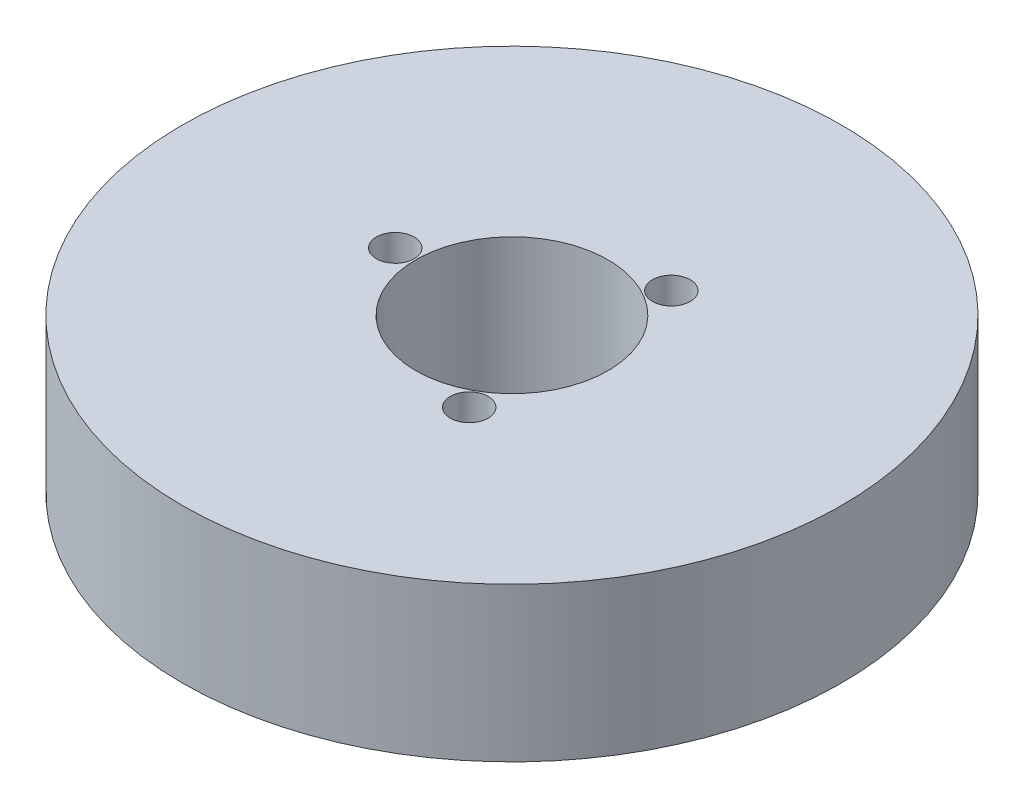
ISO-10303-21;
HEADER;
FILE_DESCRIPTION(('STEP AP214'),'2;1');
FILE_NAME('part.step','',(''),(''),'','','');
FILE_SCHEMA(('AUTOMOTIVE_DESIGN { 1 0 10303 214 1 1 1 1 }'));
ENDSEC;
DATA;
#1=APPLICATION_CONTEXT('core data for automotive mechanical design processes');
#2=APPLICATION_PROTOCOL_DEFINITION('international standard','automotive_design',2000,#1);
#3=PRODUCT_CONTEXT('',#1,'mechanical');
#4=PRODUCT('Part','Part','',(#3));
#5=PRODUCT_RELATED_PRODUCT_CATEGORY('part','',(#4));
#6=PRODUCT_DEFINITION_FORMATION('','',#4);
#7=PRODUCT_DEFINITION_CONTEXT('part definition',#1,'design');
#8=PRODUCT_DEFINITION('design','',#6,#7);
#9=PRODUCT_DEFINITION_SHAPE('','',#8);
#10=(LENGTH_UNIT() NAMED_UNIT(*) SI_UNIT(.MILLI.,.METRE.));
#11=(NAMED_UNIT(*) PLANE_ANGLE_UNIT() SI_UNIT($,.RADIAN.));
#12=(NAMED_UNIT(*) SI_UNIT($,.STERADIAN.) SOLID_ANGLE_UNIT());
#13=UNCERTAINTY_MEASURE_WITH_UNIT(LENGTH_MEASURE(1.E-05),#10,'distance_accuracy_value','');
#14=(GEOMETRIC_REPRESENTATION_CONTEXT(3) GLOBAL_UNCERTAINTY_ASSIGNED_CONTEXT((#13)) GLOBAL_UNIT_ASSIGNED_CONTEXT((#10,
#11,#12)) REPRESENTATION_CONTEXT('',''));
#15=CARTESIAN_POINT('',(0.,0.,0.));
#16=DIRECTION('',(0.,0.,1.));
#17=DIRECTION('',(1.,0.,0.));
#18=AXIS2_PLACEMENT_3D('',#15,#16,#17);
#19=CARTESIAN_POINT('',(0.,28.,0.));
#20=DIRECTION('',(0.,-1.,0.));
#21=DIRECTION('',(0.,0.,-1.));
#22=AXIS2_PLACEMENT_3D('',#19,#20,#21);
#23=CYLINDRICAL_SURFACE('',#22,60.);
#24=CARTESIAN_POINT('',(0.,28.,0.));
#25=DIRECTION('',(0.,1.,0.));
#26=DIRECTION('',(0.,0.,1.));
#27=AXIS2_PLACEMENT_3D('',#24,#25,#26);
#28=CIRCLE('',#27,60.);
#29=CARTESIAN_POINT('',(0.,28.,60.));
#30=VERTEX_POINT('',#29);
#31=EDGE_CURVE('E10',#30,#30,#28,.T.);
#32=ORIENTED_EDGE('',*,*,#31,.F.);
#33=EDGE_LOOP('',(#32));
#34=FACE_BOUND('',#33,.T.);
#35=CARTESIAN_POINT('',(0.,0.,0.));
#36=DIRECTION('',(0.,1.,0.));
#37=DIRECTION('',(0.,0.,1.));
#38=AXIS2_PLACEMENT_3D('',#35,#36,#37);
#39=CIRCLE('',#38,60.);
#40=CARTESIAN_POINT('',(0.,0.,60.));
#41=VERTEX_POINT('',#40);
#42=EDGE_CURVE('E37',#41,#41,#39,.T.);
#43=ORIENTED_EDGE('',*,*,#42,.T.);
#44=EDGE_LOOP('',(#43));
#45=FACE_BOUND('',#44,.T.);
#46=ADVANCED_FACE('F40',(#34,#45),#23,.T.);
#47=CARTESIAN_POINT('',(0.,28.,0.));
#48=DIRECTION('',(0.,1.,0.));
#49=DIRECTION('',(0.,0.,1.));
#50=AXIS2_PLACEMENT_3D('',#47,#48,#49);
#51=PLANE('',#50);
#52=CARTESIAN_POINT('',(10.6222236300377,28.,18.3982310165838));
#53=DIRECTION('',(0.,1.,0.));
#54=DIRECTION('',(0.866025403784436,0.,-0.500000000000004));
#55=AXIS2_PLACEMENT_3D('',#52,#53,#54);
#56=CIRCLE('',#55,3.44067264914023);
#57=CARTESIAN_POINT('',(13.6019335502994,28.,16.6778946920136));
#58=VERTEX_POINT('',#57);
#59=EDGE_CURVE('E70',#58,#58,#56,.T.);
#60=ORIENTED_EDGE('',*,*,#59,.F.);
#61=EDGE_LOOP('',(#60));
#62=FACE_BOUND('',#61,.T.);
#63=CARTESIAN_POINT('',(10.6222236300374,28.,-18.3982310165839));
#64=DIRECTION('',(0.,1.,0.));
#65=DIRECTION('',(-0.866025403784443,0.,-0.499999999999992));
#66=AXIS2_PLACEMENT_3D('',#63,#64,#65);
#67=CIRCLE('',#66,3.44067264914023);
#68=CARTESIAN_POINT('',(7.64251370977566,28.,-20.118567341154));
#69=VERTEX_POINT('',#68);
#70=EDGE_CURVE('E61',#69,#69,#67,.T.);
#71=ORIENTED_EDGE('',*,*,#70,.F.);
#72=EDGE_LOOP('',(#71));
#73=FACE_BOUND('',#72,.T.);
#74=CARTESIAN_POINT('',(-21.2444472600752,28.,0.));
#75=DIRECTION('',(0.,1.,0.));
#76=DIRECTION('',(0.,0.,1.));
#77=AXIS2_PLACEMENT_3D('',#74,#75,#76);
#78=CIRCLE('',#77,3.44067264914023);
#79=CARTESIAN_POINT('',(-21.2444472600752,28.,3.44067264914023));
#80=VERTEX_POINT('',#79);
#81=EDGE_CURVE('E54',#80,#80,#78,.T.);
#82=ORIENTED_EDGE('',*,*,#81,.F.);
#83=EDGE_LOOP('',(#82));
#84=FACE_BOUND('',#83,.T.);
#85=CARTESIAN_POINT('',(0.,28.,0.));
#86=DIRECTION('',(0.,1.,0.));
#87=DIRECTION('',(0.,0.,1.));
#88=AXIS2_PLACEMENT_3D('',#85,#86,#87);
#89=CIRCLE('',#88,17.5);
#90=CARTESIAN_POINT('',(0.,28.,17.5));
#91=VERTEX_POINT('',#90);
#92=EDGE_CURVE('E50',#91,#91,#89,.T.);
#93=ORIENTED_EDGE('',*,*,#92,.F.);
#94=EDGE_LOOP('',(#93));
#95=FACE_BOUND('',#94,.T.);
#96=ORIENTED_EDGE('',*,*,#31,.T.);
#97=EDGE_LOOP('',(#96));
#98=FACE_BOUND('',#97,.T.);
#99=ADVANCED_FACE('F85',(#62,#73,#84,#95,#98),#51,.T.);
#100=CARTESIAN_POINT('',(0.,0.,0.));
#101=DIRECTION('',(0.,1.,0.));
#102=DIRECTION('',(0.,0.,1.));
#103=AXIS2_PLACEMENT_3D('',#100,#101,#102);
#104=PLANE('',#103);
#105=CARTESIAN_POINT('',(0.,0.,0.));
#106=DIRECTION('',(0.,1.,0.));
#107=DIRECTION('',(0.,0.,1.));
#108=AXIS2_PLACEMENT_3D('',#105,#106,#107);
#109=CIRCLE('',#108,17.5);
#110=CARTESIAN_POINT('',(0.,0.,17.5));
#111=VERTEX_POINT('',#110);
#112=EDGE_CURVE('E47',#111,#111,#109,.T.);
#113=ORIENTED_EDGE('',*,*,#112,.T.);
#114=EDGE_LOOP('',(#113));
#115=FACE_BOUND('',#114,.T.);
#116=ORIENTED_EDGE('',*,*,#42,.F.);
#117=EDGE_LOOP('',(#116));
#118=FACE_BOUND('',#117,.T.);
#119=ADVANCED_FACE('F84',(#115,#118),#104,.F.);
#120=CARTESIAN_POINT('',(0.,28.,0.));
#121=DIRECTION('',(0.,-1.,0.));
#122=DIRECTION('',(0.,0.,-1.));
#123=AXIS2_PLACEMENT_3D('',#120,#121,#122);
#124=CYLINDRICAL_SURFACE('',#123,17.5);
#125=ORIENTED_EDGE('',*,*,#92,.T.);
#126=EDGE_LOOP('',(#125));
#127=FACE_BOUND('',#126,.T.);
#128=ORIENTED_EDGE('',*,*,#112,.F.);
#129=EDGE_LOOP('',(#128));
#130=FACE_BOUND('',#129,.T.);
#131=ADVANCED_FACE('F91',(#127,#130),#124,.F.);
#132=CARTESIAN_POINT('',(-21.2444472600752,7.56951466277875,0.));
#133=DIRECTION('',(0.,1.,0.));
#134=DIRECTION('',(0.,0.,1.));
#135=AXIS2_PLACEMENT_3D('',#132,#133,#134);
#136=CYLINDRICAL_SURFACE('',#135,3.44067264914023);
#137=CARTESIAN_POINT('',(-21.2444472600752,7.56951466277875,0.));
#138=DIRECTION('',(0.,1.,0.));
#139=DIRECTION('',(0.,0.,1.));
#140=AXIS2_PLACEMENT_3D('',#137,#138,#139);
#141=CIRCLE('',#140,3.44067264914023);
#142=CARTESIAN_POINT('',(-21.2444472600752,7.56951466277875,3.44067264914023));
#143=VERTEX_POINT('',#142);
#144=EDGE_CURVE('E55',#143,#143,#141,.T.);
#145=ORIENTED_EDGE('',*,*,#144,.F.);
#146=EDGE_LOOP('',(#145));
#147=FACE_BOUND('',#146,.T.);
#148=ORIENTED_EDGE('',*,*,#81,.T.);
#149=EDGE_LOOP('',(#148));
#150=FACE_BOUND('',#149,.T.);
#151=ADVANCED_FACE('F96',(#147,#150),#136,.F.);
#152=CARTESIAN_POINT('',(-21.2444472600752,7.56951466277875,0.));
#153=DIRECTION('',(0.,1.,0.));
#154=DIRECTION('',(0.,0.,1.));
#155=AXIS2_PLACEMENT_3D('',#152,#153,#154);
#156=PLANE('',#155);
#157=ORIENTED_EDGE('',*,*,#144,.T.);
#158=EDGE_LOOP('',(#157));
#159=FACE_BOUND('',#158,.T.);
#160=ADVANCED_FACE('F127',(#159),#156,.T.);
#161=CARTESIAN_POINT('',(10.6222236300374,7.56951466277875,-18.3982310165839));
#162=DIRECTION('',(0.,1.,0.));
#163=DIRECTION('',(0.,0.,1.));
#164=AXIS2_PLACEMENT_3D('',#161,#162,#163);
#165=CYLINDRICAL_SURFACE('',#164,3.44067264914023);
#166=CARTESIAN_POINT('',(10.6222236300374,7.56951466277875,-18.3982310165839));
#167=DIRECTION('',(0.,1.,0.));
#168=DIRECTION('',(-0.866025403784443,0.,-0.499999999999992));
#169=AXIS2_PLACEMENT_3D('',#166,#167,#168);
#170=CIRCLE('',#169,3.44067264914023);
#171=CARTESIAN_POINT('',(7.64251370977566,7.56951466277875,-20.118567341154));
#172=VERTEX_POINT('',#171);
#173=EDGE_CURVE('E63',#172,#172,#170,.T.);
#174=ORIENTED_EDGE('',*,*,#173,.F.);
#175=EDGE_LOOP('',(#174));
#176=FACE_BOUND('',#175,.T.);
#177=ORIENTED_EDGE('',*,*,#70,.T.);
#178=EDGE_LOOP('',(#177));
#179=FACE_BOUND('',#178,.T.);
#180=ADVANCED_FACE('F133',(#176,#179),#165,.F.);
#181=CARTESIAN_POINT('',(10.6222236300374,7.56951466277875,-18.3982310165839));
#182=DIRECTION('',(0.,1.,0.));
#183=DIRECTION('',(-0.866025403784443,0.,-0.499999999999992));
#184=AXIS2_PLACEMENT_3D('',#181,#182,#183);
#185=PLANE('',#184);
#186=ORIENTED_EDGE('',*,*,#173,.T.);
#187=EDGE_LOOP('',(#186));
#188=FACE_BOUND('',#187,.T.);
#189=ADVANCED_FACE('F77',(#188),#185,.T.);
#190=CARTESIAN_POINT('',(10.6222236300377,7.56951466277875,18.3982310165838));
#191=DIRECTION('',(0.,1.,0.));
#192=DIRECTION('',(0.,0.,1.));
#193=AXIS2_PLACEMENT_3D('',#190,#191,#192);
#194=CYLINDRICAL_SURFACE('',#193,3.44067264914023);
#195=CARTESIAN_POINT('',(10.6222236300377,7.56951466277875,18.3982310165838));
#196=DIRECTION('',(0.,1.,0.));
#197=DIRECTION('',(0.866025403784436,0.,-0.500000000000004));
#198=AXIS2_PLACEMENT_3D('',#195,#196,#197);
#199=CIRCLE('',#198,3.44067264914023);
#200=CARTESIAN_POINT('',(13.6019335502994,7.56951466277875,16.6778946920136));
#201=VERTEX_POINT('',#200);
#202=EDGE_CURVE('E59',#201,#201,#199,.T.);
#203=ORIENTED_EDGE('',*,*,#202,.F.);
#204=EDGE_LOOP('',(#203));
#205=FACE_BOUND('',#204,.T.);
#206=ORIENTED_EDGE('',*,*,#59,.T.);
#207=EDGE_LOOP('',(#206));
#208=FACE_BOUND('',#207,.T.);
#209=ADVANCED_FACE('F73',(#205,#208),#194,.F.);
#210=CARTESIAN_POINT('',(10.6222236300377,7.56951466277875,18.3982310165838));
#211=DIRECTION('',(0.,1.,0.));
#212=DIRECTION('',(0.866025403784436,0.,-0.500000000000004));
#213=AXIS2_PLACEMENT_3D('',#210,#211,#212);
#214=PLANE('',#213);
#215=ORIENTED_EDGE('',*,*,#202,.T.);
#216=EDGE_LOOP('',(#215));
#217=FACE_BOUND('',#216,.T.);
#218=ADVANCED_FACE('F71',(#217),#214,.T.);
#219=CLOSED_SHELL('',(#46,#99,#119,#131,#151,#160,#180,#189,#209,#218));
#220=MANIFOLD_SOLID_BREP('B2',#219);
#221=ADVANCED_BREP_SHAPE_REPRESENTATION('',(#18,#220),#14);
#222=SHAPE_DEFINITION_REPRESENTATION(#9,#221);
ENDSEC;
END-ISO-10303-21;
